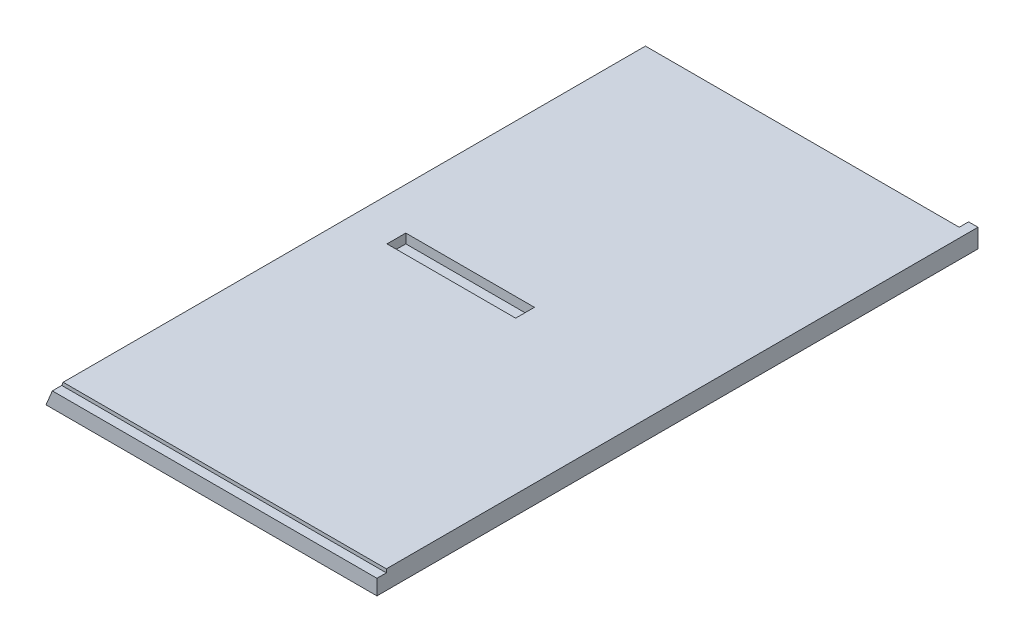
ISO-10303-21;
HEADER;
FILE_DESCRIPTION(('STEP AP214'),'2;1');
FILE_NAME('part.step','',(''),(''),'','','');
FILE_SCHEMA(('AUTOMOTIVE_DESIGN { 1 0 10303 214 1 1 1 1 }'));
ENDSEC;
DATA;
#1=APPLICATION_CONTEXT('core data for automotive mechanical design processes');
#2=APPLICATION_PROTOCOL_DEFINITION('international standard','automotive_design',2000,#1);
#3=PRODUCT_CONTEXT('',#1,'mechanical');
#4=PRODUCT('Part','Part','',(#3));
#5=PRODUCT_RELATED_PRODUCT_CATEGORY('part','',(#4));
#6=PRODUCT_DEFINITION_FORMATION('','',#4);
#7=PRODUCT_DEFINITION_CONTEXT('part definition',#1,'design');
#8=PRODUCT_DEFINITION('design','',#6,#7);
#9=PRODUCT_DEFINITION_SHAPE('','',#8);
#10=(LENGTH_UNIT() NAMED_UNIT(*) SI_UNIT(.MILLI.,.METRE.));
#11=(NAMED_UNIT(*) PLANE_ANGLE_UNIT() SI_UNIT($,.RADIAN.));
#12=(NAMED_UNIT(*) SI_UNIT($,.STERADIAN.) SOLID_ANGLE_UNIT());
#13=UNCERTAINTY_MEASURE_WITH_UNIT(LENGTH_MEASURE(1.E-05),#10,'distance_accuracy_value','');
#14=(GEOMETRIC_REPRESENTATION_CONTEXT(3) GLOBAL_UNCERTAINTY_ASSIGNED_CONTEXT((#13)) GLOBAL_UNIT_ASSIGNED_CONTEXT((#10,
#11,#12)) REPRESENTATION_CONTEXT('',''));
#15=CARTESIAN_POINT('',(0.,0.,0.));
#16=DIRECTION('',(0.,0.,1.));
#17=DIRECTION('',(1.,0.,0.));
#18=AXIS2_PLACEMENT_3D('',#15,#16,#17);
#19=CARTESIAN_POINT('',(5.26051224213836,12.7,406.4));
#20=DIRECTION('',(0.,-1.,0.));
#21=DIRECTION('',(1.,0.,0.));
#22=AXIS2_PLACEMENT_3D('',#19,#20,#21);
#23=PLANE('',#22);
#24=DIRECTION('',(0.,0.,-1.));
#25=VECTOR('',#24,1.);
#26=CARTESIAN_POINT('',(120.698548215533,12.7,209.55));
#27=LINE('',#26,#25);
#28=CARTESIAN_POINT('',(120.698548215533,12.7,209.55));
#29=VERTEX_POINT('',#28);
#30=CARTESIAN_POINT('',(120.698548215533,12.7,196.85));
#31=VERTEX_POINT('',#30);
#32=EDGE_CURVE('E48',#29,#31,#27,.T.);
#33=ORIENTED_EDGE('',*,*,#32,.F.);
#34=DIRECTION('',(-1.,0.,0.));
#35=VECTOR('',#34,1.);
#36=CARTESIAN_POINT('',(5.26051224213836,12.7,209.55));
#37=LINE('',#36,#35);
#38=CARTESIAN_POINT('',(33.7223472653998,12.6999999999999,209.55));
#39=VERTEX_POINT('',#38);
#40=EDGE_CURVE('E148',#29,#39,#37,.T.);
#41=ORIENTED_EDGE('',*,*,#40,.T.);
#42=DIRECTION('',(0.,0.,-1.));
#43=VECTOR('',#42,1.);
#44=CARTESIAN_POINT('',(33.7223472653998,12.6999999999999,209.55));
#45=LINE('',#44,#43);
#46=CARTESIAN_POINT('',(33.7223472653998,12.6999999999999,196.85));
#47=VERTEX_POINT('',#46);
#48=EDGE_CURVE('E131',#39,#47,#45,.T.);
#49=ORIENTED_EDGE('',*,*,#48,.T.);
#50=DIRECTION('',(-1.,0.,0.));
#51=VECTOR('',#50,1.);
#52=CARTESIAN_POINT('',(5.26051224213836,12.7,196.85));
#53=LINE('',#52,#51);
#54=EDGE_CURVE('E141',#31,#47,#53,.T.);
#55=ORIENTED_EDGE('',*,*,#54,.F.);
#56=EDGE_LOOP('',(#33,#41,#49,#55));
#57=FACE_BOUND('',#56,.T.);
#58=DIRECTION('',(-1.,0.,0.));
#59=VECTOR('',#58,1.);
#60=CARTESIAN_POINT('',(217.424,12.7,6.35));
#61=LINE('',#60,#59);
#62=CARTESIAN_POINT('',(217.424,12.7,6.35));
#63=VERTEX_POINT('',#62);
#64=CARTESIAN_POINT('',(5.26051224213836,12.7,6.34999999999997));
#65=VERTEX_POINT('',#64);
#66=EDGE_CURVE('E176',#63,#65,#61,.T.);
#67=ORIENTED_EDGE('',*,*,#66,.T.);
#68=DIRECTION('',(0.,0.,-1.));
#69=VECTOR('',#68,1.);
#70=CARTESIAN_POINT('',(5.26051224213836,12.7,406.4));
#71=LINE('',#70,#69);
#72=CARTESIAN_POINT('',(5.26051224213836,12.7,400.05));
#73=VERTEX_POINT('',#72);
#74=EDGE_CURVE('E213',#73,#65,#71,.T.);
#75=ORIENTED_EDGE('',*,*,#74,.F.);
#76=DIRECTION('',(1.,0.,0.));
#77=VECTOR('',#76,1.);
#78=CARTESIAN_POINT('',(0.,12.7,400.05));
#79=LINE('',#78,#77);
#80=CARTESIAN_POINT('',(223.774,12.7,400.05));
#81=VERTEX_POINT('',#80);
#82=EDGE_CURVE('E153',#73,#81,#79,.T.);
#83=ORIENTED_EDGE('',*,*,#82,.T.);
#84=DIRECTION('',(0.,0.,-1.));
#85=VECTOR('',#84,1.);
#86=CARTESIAN_POINT('',(223.774,12.7,406.4));
#87=LINE('',#86,#85);
#88=CARTESIAN_POINT('',(223.774,12.7,0.));
#89=VERTEX_POINT('',#88);
#90=EDGE_CURVE('E215',#81,#89,#87,.T.);
#91=ORIENTED_EDGE('',*,*,#90,.T.);
#92=DIRECTION('',(-1.,0.,0.));
#93=VECTOR('',#92,1.);
#94=CARTESIAN_POINT('',(5.26051224213836,12.7,0.));
#95=LINE('',#94,#93);
#96=CARTESIAN_POINT('',(217.424,12.7,0.));
#97=VERTEX_POINT('',#96);
#98=EDGE_CURVE('E207',#89,#97,#95,.T.);
#99=ORIENTED_EDGE('',*,*,#98,.T.);
#100=DIRECTION('',(0.,0.,1.));
#101=VECTOR('',#100,1.);
#102=CARTESIAN_POINT('',(217.424,12.7,6.35));
#103=LINE('',#102,#101);
#104=EDGE_CURVE('E171',#97,#63,#103,.T.);
#105=ORIENTED_EDGE('',*,*,#104,.T.);
#106=EDGE_LOOP('',(#67,#75,#83,#91,#99,#105));
#107=FACE_BOUND('',#106,.T.);
#108=ADVANCED_FACE('F33',(#57,#107),#23,.F.);
#109=CARTESIAN_POINT('',(0.,0.,406.4));
#110=DIRECTION('',(0.923879532511285,-0.382683432365094,0.));
#111=DIRECTION('',(0.382683432365094,0.923879532511285,0.));
#112=AXIS2_PLACEMENT_3D('',#109,#110,#111);
#113=PLANE('',#112);
#114=DIRECTION('',(-0.382683432365094,-0.923879532511285,0.));
#115=VECTOR('',#114,1.);
#116=CARTESIAN_POINT('',(0.,0.,400.05));
#117=LINE('',#116,#115);
#118=CARTESIAN_POINT('',(4.28205696510062,10.3378,400.05));
#119=VERTEX_POINT('',#118);
#120=EDGE_CURVE('E169',#73,#119,#117,.T.);
#121=ORIENTED_EDGE('',*,*,#120,.F.);
#122=ORIENTED_EDGE('',*,*,#74,.T.);
#123=DIRECTION('',(0.382683432365094,0.923879532511285,0.));
#124=VECTOR('',#123,1.);
#125=CARTESIAN_POINT('',(0.,0.,6.35000000000002));
#126=LINE('',#125,#124);
#127=CARTESIAN_POINT('',(2.63025612106918,6.34999999999997,6.34999999999997));
#128=VERTEX_POINT('',#127);
#129=EDGE_CURVE('E11',#128,#65,#126,.T.);
#130=ORIENTED_EDGE('',*,*,#129,.F.);
#131=DIRECTION('',(0.,0.,1.));
#132=VECTOR('',#131,1.);
#133=CARTESIAN_POINT('',(2.63025612106917,6.34999999999997,406.4));
#134=LINE('',#133,#132);
#135=CARTESIAN_POINT('',(2.63025612106918,6.34999999999997,0.));
#136=VERTEX_POINT('',#135);
#137=EDGE_CURVE('E189',#136,#128,#134,.T.);
#138=ORIENTED_EDGE('',*,*,#137,.F.);
#139=DIRECTION('',(-0.382683432365094,-0.923879532511285,0.));
#140=VECTOR('',#139,1.);
#141=CARTESIAN_POINT('',(0.,0.,0.));
#142=LINE('',#141,#140);
#143=CARTESIAN_POINT('',(0.,0.,0.));
#144=VERTEX_POINT('',#143);
#145=EDGE_CURVE('E196',#136,#144,#142,.T.);
#146=ORIENTED_EDGE('',*,*,#145,.T.);
#147=DIRECTION('',(0.,0.,-1.));
#148=VECTOR('',#147,1.);
#149=CARTESIAN_POINT('',(0.,0.,406.4));
#150=LINE('',#149,#148);
#151=CARTESIAN_POINT('',(0.,0.,406.4));
#152=VERTEX_POINT('',#151);
#153=EDGE_CURVE('E201',#152,#144,#150,.T.);
#154=ORIENTED_EDGE('',*,*,#153,.F.);
#155=DIRECTION('',(-0.382683432365094,-0.923879532511285,0.));
#156=VECTOR('',#155,1.);
#157=CARTESIAN_POINT('',(0.,0.,406.4));
#158=LINE('',#157,#156);
#159=CARTESIAN_POINT('',(4.28205696510062,10.3378,406.4));
#160=VERTEX_POINT('',#159);
#161=EDGE_CURVE('E199',#160,#152,#158,.T.);
#162=ORIENTED_EDGE('',*,*,#161,.F.);
#163=DIRECTION('',(0.,0.,-1.));
#164=VECTOR('',#163,1.);
#165=CARTESIAN_POINT('',(4.28205696510062,10.3378,406.4));
#166=LINE('',#165,#164);
#167=EDGE_CURVE('E56',#160,#119,#166,.T.);
#168=ORIENTED_EDGE('',*,*,#167,.T.);
#169=EDGE_LOOP('',(#121,#122,#130,#138,#146,#154,#162,#168));
#170=FACE_BOUND('',#169,.T.);
#171=ADVANCED_FACE('F229',(#170),#113,.F.);
#172=CARTESIAN_POINT('',(223.774,12.7,406.4));
#173=DIRECTION('',(-1.,0.,0.));
#174=DIRECTION('',(0.,0.,1.));
#175=AXIS2_PLACEMENT_3D('',#172,#173,#174);
#176=PLANE('',#175);
#177=DIRECTION('',(0.,1.,0.));
#178=VECTOR('',#177,1.);
#179=CARTESIAN_POINT('',(223.774,10.3378,400.05));
#180=LINE('',#179,#178);
#181=CARTESIAN_POINT('',(223.774,10.3378,400.05));
#182=VERTEX_POINT('',#181);
#183=EDGE_CURVE('E165',#182,#81,#180,.T.);
#184=ORIENTED_EDGE('',*,*,#183,.F.);
#185=DIRECTION('',(0.,0.,1.));
#186=VECTOR('',#185,1.);
#187=CARTESIAN_POINT('',(223.774,10.3378,406.4));
#188=LINE('',#187,#186);
#189=CARTESIAN_POINT('',(223.774,10.3378,406.4));
#190=VERTEX_POINT('',#189);
#191=EDGE_CURVE('E161',#182,#190,#188,.T.);
#192=ORIENTED_EDGE('',*,*,#191,.T.);
#193=DIRECTION('',(0.,1.,0.));
#194=VECTOR('',#193,1.);
#195=CARTESIAN_POINT('',(223.774,12.7,406.4));
#196=LINE('',#195,#194);
#197=CARTESIAN_POINT('',(223.774,0.,406.4));
#198=VERTEX_POINT('',#197);
#199=EDGE_CURVE('E195',#198,#190,#196,.T.);
#200=ORIENTED_EDGE('',*,*,#199,.F.);
#201=DIRECTION('',(0.,0.,-1.));
#202=VECTOR('',#201,1.);
#203=CARTESIAN_POINT('',(223.774,0.,406.4));
#204=LINE('',#203,#202);
#205=CARTESIAN_POINT('',(223.774,0.,0.));
#206=VERTEX_POINT('',#205);
#207=EDGE_CURVE('E217',#198,#206,#204,.T.);
#208=ORIENTED_EDGE('',*,*,#207,.T.);
#209=DIRECTION('',(0.,1.,0.));
#210=VECTOR('',#209,1.);
#211=CARTESIAN_POINT('',(223.774,12.7,0.));
#212=LINE('',#211,#210);
#213=EDGE_CURVE('E204',#206,#89,#212,.T.);
#214=ORIENTED_EDGE('',*,*,#213,.T.);
#215=ORIENTED_EDGE('',*,*,#90,.F.);
#216=EDGE_LOOP('',(#184,#192,#200,#208,#214,#215));
#217=FACE_BOUND('',#216,.T.);
#218=ADVANCED_FACE('F244',(#217),#176,.F.);
#219=CARTESIAN_POINT('',(0.,0.,0.));
#220=DIRECTION('',(0.,0.,1.));
#221=DIRECTION('',(1.,0.,0.));
#222=AXIS2_PLACEMENT_3D('',#219,#220,#221);
#223=PLANE('',#222);
#224=DIRECTION('',(0.,1.,0.));
#225=VECTOR('',#224,1.);
#226=CARTESIAN_POINT('',(217.424,6.34999999999999,0.));
#227=LINE('',#226,#225);
#228=CARTESIAN_POINT('',(217.424,6.34999999999999,0.));
#229=VERTEX_POINT('',#228);
#230=EDGE_CURVE('E179',#229,#97,#227,.T.);
#231=ORIENTED_EDGE('',*,*,#230,.T.);
#232=ORIENTED_EDGE('',*,*,#98,.F.);
#233=ORIENTED_EDGE('',*,*,#213,.F.);
#234=DIRECTION('',(1.,0.,0.));
#235=VECTOR('',#234,1.);
#236=CARTESIAN_POINT('',(223.774,0.,0.));
#237=LINE('',#236,#235);
#238=EDGE_CURVE('E191',#144,#206,#237,.T.);
#239=ORIENTED_EDGE('',*,*,#238,.F.);
#240=ORIENTED_EDGE('',*,*,#145,.F.);
#241=DIRECTION('',(-1.,0.,0.));
#242=VECTOR('',#241,1.);
#243=CARTESIAN_POINT('',(0.,6.34999999999997,0.));
#244=LINE('',#243,#242);
#245=EDGE_CURVE('E41',#229,#136,#244,.T.);
#246=ORIENTED_EDGE('',*,*,#245,.F.);
#247=EDGE_LOOP('',(#231,#232,#233,#239,#240,#246));
#248=FACE_BOUND('',#247,.T.);
#249=ADVANCED_FACE('F232',(#248),#223,.F.);
#250=CARTESIAN_POINT('',(223.774,0.,406.4));
#251=DIRECTION('',(0.,1.,0.));
#252=DIRECTION('',(-1.,0.,0.));
#253=AXIS2_PLACEMENT_3D('',#250,#251,#252);
#254=PLANE('',#253);
#255=ORIENTED_EDGE('',*,*,#238,.T.);
#256=ORIENTED_EDGE('',*,*,#207,.F.);
#257=DIRECTION('',(1.,0.,0.));
#258=VECTOR('',#257,1.);
#259=CARTESIAN_POINT('',(223.774,0.,406.4));
#260=LINE('',#259,#258);
#261=EDGE_CURVE('E192',#152,#198,#260,.T.);
#262=ORIENTED_EDGE('',*,*,#261,.F.);
#263=ORIENTED_EDGE('',*,*,#153,.T.);
#264=EDGE_LOOP('',(#255,#256,#262,#263));
#265=FACE_BOUND('',#264,.T.);
#266=ADVANCED_FACE('F35',(#265),#254,.F.);
#267=CARTESIAN_POINT('',(0.,0.,406.4));
#268=DIRECTION('',(0.,0.,1.));
#269=DIRECTION('',(1.,0.,0.));
#270=AXIS2_PLACEMENT_3D('',#267,#268,#269);
#271=PLANE('',#270);
#272=DIRECTION('',(-1.,0.,0.));
#273=VECTOR('',#272,1.);
#274=CARTESIAN_POINT('',(0.,10.3378,406.4));
#275=LINE('',#274,#273);
#276=EDGE_CURVE('E164',#190,#160,#275,.T.);
#277=ORIENTED_EDGE('',*,*,#276,.T.);
#278=ORIENTED_EDGE('',*,*,#161,.T.);
#279=ORIENTED_EDGE('',*,*,#261,.T.);
#280=ORIENTED_EDGE('',*,*,#199,.T.);
#281=EDGE_LOOP('',(#277,#278,#279,#280));
#282=FACE_BOUND('',#281,.T.);
#283=ADVANCED_FACE('F239',(#282),#271,.T.);
#284=CARTESIAN_POINT('',(217.424,6.34999999999999,6.35));
#285=DIRECTION('',(0.,0.,-1.));
#286=DIRECTION('',(-1.,0.,0.));
#287=AXIS2_PLACEMENT_3D('',#284,#285,#286);
#288=PLANE('',#287);
#289=ORIENTED_EDGE('',*,*,#129,.T.);
#290=ORIENTED_EDGE('',*,*,#66,.F.);
#291=DIRECTION('',(0.,1.,0.));
#292=VECTOR('',#291,1.);
#293=CARTESIAN_POINT('',(217.424,6.34999999999999,6.35));
#294=LINE('',#293,#292);
#295=CARTESIAN_POINT('',(217.424,6.34999999999999,6.35));
#296=VERTEX_POINT('',#295);
#297=EDGE_CURVE('E186',#296,#63,#294,.T.);
#298=ORIENTED_EDGE('',*,*,#297,.F.);
#299=DIRECTION('',(-1.,0.,0.));
#300=VECTOR('',#299,1.);
#301=CARTESIAN_POINT('',(217.424,6.34999999999999,6.35));
#302=LINE('',#301,#300);
#303=EDGE_CURVE('E175',#296,#128,#302,.T.);
#304=ORIENTED_EDGE('',*,*,#303,.T.);
#305=EDGE_LOOP('',(#289,#290,#298,#304));
#306=FACE_BOUND('',#305,.T.);
#307=ADVANCED_FACE('F250',(#306),#288,.T.);
#308=CARTESIAN_POINT('',(0.,6.34999999999997,0.));
#309=DIRECTION('',(0.,1.,0.));
#310=DIRECTION('',(-1.,0.,0.));
#311=AXIS2_PLACEMENT_3D('',#308,#309,#310);
#312=PLANE('',#311);
#313=ORIENTED_EDGE('',*,*,#137,.T.);
#314=ORIENTED_EDGE('',*,*,#303,.F.);
#315=DIRECTION('',(0.,0.,1.));
#316=VECTOR('',#315,1.);
#317=CARTESIAN_POINT('',(217.424,6.34999999999999,6.35));
#318=LINE('',#317,#316);
#319=EDGE_CURVE('E172',#229,#296,#318,.T.);
#320=ORIENTED_EDGE('',*,*,#319,.F.);
#321=ORIENTED_EDGE('',*,*,#245,.T.);
#322=EDGE_LOOP('',(#313,#314,#320,#321));
#323=FACE_BOUND('',#322,.T.);
#324=ADVANCED_FACE('F222',(#323),#312,.T.);
#325=CARTESIAN_POINT('',(217.424,6.34999999999999,6.35));
#326=DIRECTION('',(-1.,0.,0.));
#327=DIRECTION('',(0.,-1.,0.));
#328=AXIS2_PLACEMENT_3D('',#325,#326,#327);
#329=PLANE('',#328);
#330=ORIENTED_EDGE('',*,*,#104,.F.);
#331=ORIENTED_EDGE('',*,*,#230,.F.);
#332=ORIENTED_EDGE('',*,*,#319,.T.);
#333=ORIENTED_EDGE('',*,*,#297,.T.);
#334=EDGE_LOOP('',(#330,#331,#332,#333));
#335=FACE_BOUND('',#334,.T.);
#336=ADVANCED_FACE('F253',(#335),#329,.T.);
#337=CARTESIAN_POINT('',(0.,10.3378,400.05));
#338=DIRECTION('',(0.,0.,1.));
#339=DIRECTION('',(1.,0.,0.));
#340=AXIS2_PLACEMENT_3D('',#337,#338,#339);
#341=PLANE('',#340);
#342=ORIENTED_EDGE('',*,*,#120,.T.);
#343=DIRECTION('',(1.,0.,0.));
#344=VECTOR('',#343,1.);
#345=CARTESIAN_POINT('',(0.,10.3378,400.05));
#346=LINE('',#345,#344);
#347=EDGE_CURVE('E156',#119,#182,#346,.T.);
#348=ORIENTED_EDGE('',*,*,#347,.T.);
#349=ORIENTED_EDGE('',*,*,#183,.T.);
#350=ORIENTED_EDGE('',*,*,#82,.F.);
#351=EDGE_LOOP('',(#342,#348,#349,#350));
#352=FACE_BOUND('',#351,.T.);
#353=ADVANCED_FACE('F247',(#352),#341,.T.);
#354=CARTESIAN_POINT('',(0.,10.3378,0.));
#355=DIRECTION('',(0.,-1.,0.));
#356=DIRECTION('',(1.,0.,0.));
#357=AXIS2_PLACEMENT_3D('',#354,#355,#356);
#358=PLANE('',#357);
#359=ORIENTED_EDGE('',*,*,#276,.F.);
#360=ORIENTED_EDGE('',*,*,#191,.F.);
#361=ORIENTED_EDGE('',*,*,#347,.F.);
#362=ORIENTED_EDGE('',*,*,#167,.F.);
#363=EDGE_LOOP('',(#359,#360,#361,#362));
#364=FACE_BOUND('',#363,.T.);
#365=ADVANCED_FACE('F241',(#364),#358,.F.);
#366=CARTESIAN_POINT('',(-886.993305173515,767.615446324431,209.55));
#367=DIRECTION('',(0.,0.,1.));
#368=DIRECTION('',(0.,-1.,0.));
#369=AXIS2_PLACEMENT_3D('',#366,#367,#368);
#370=PLANE('',#369);
#371=DIRECTION('',(0.,1.,0.));
#372=VECTOR('',#371,1.);
#373=CARTESIAN_POINT('',(120.698548215533,12.7,209.55));
#374=LINE('',#373,#372);
#375=CARTESIAN_POINT('',(120.698548215533,6.35000000000008,209.55));
#376=VERTEX_POINT('',#375);
#377=EDGE_CURVE('E395',#376,#29,#374,.T.);
#378=ORIENTED_EDGE('',*,*,#377,.F.);
#379=DIRECTION('',(1.,0.,0.));
#380=VECTOR('',#379,1.);
#381=CARTESIAN_POINT('',(120.698548215533,6.35000000000008,209.55));
#382=LINE('',#381,#380);
#383=CARTESIAN_POINT('',(33.7223472653998,6.34999999999997,209.55));
#384=VERTEX_POINT('',#383);
#385=EDGE_CURVE('E149',#384,#376,#382,.T.);
#386=ORIENTED_EDGE('',*,*,#385,.F.);
#387=DIRECTION('',(0.,-1.,0.));
#388=VECTOR('',#387,1.);
#389=CARTESIAN_POINT('',(33.7223472653998,6.34999999999997,209.55));
#390=LINE('',#389,#388);
#391=EDGE_CURVE('E135',#39,#384,#390,.T.);
#392=ORIENTED_EDGE('',*,*,#391,.F.);
#393=ORIENTED_EDGE('',*,*,#40,.F.);
#394=EDGE_LOOP('',(#378,#386,#392,#393));
#395=FACE_BOUND('',#394,.T.);
#396=ADVANCED_FACE('F147',(#395),#370,.F.);
#397=CARTESIAN_POINT('',(-886.993305173515,767.615446324431,196.85));
#398=DIRECTION('',(0.,0.,1.));
#399=DIRECTION('',(0.,-1.,0.));
#400=AXIS2_PLACEMENT_3D('',#397,#398,#399);
#401=PLANE('',#400);
#402=ORIENTED_EDGE('',*,*,#54,.T.);
#403=DIRECTION('',(0.,-1.,0.));
#404=VECTOR('',#403,1.);
#405=CARTESIAN_POINT('',(33.7223472653998,6.34999999999997,196.85));
#406=LINE('',#405,#404);
#407=CARTESIAN_POINT('',(33.7223472653998,6.34999999999997,196.85));
#408=VERTEX_POINT('',#407);
#409=EDGE_CURVE('E137',#47,#408,#406,.T.);
#410=ORIENTED_EDGE('',*,*,#409,.T.);
#411=DIRECTION('',(1.,0.,0.));
#412=VECTOR('',#411,1.);
#413=CARTESIAN_POINT('',(120.698548215533,6.35000000000008,196.85));
#414=LINE('',#413,#412);
#415=CARTESIAN_POINT('',(120.698548215533,6.35000000000008,196.85));
#416=VERTEX_POINT('',#415);
#417=EDGE_CURVE('E386',#408,#416,#414,.T.);
#418=ORIENTED_EDGE('',*,*,#417,.T.);
#419=DIRECTION('',(0.,1.,0.));
#420=VECTOR('',#419,1.);
#421=CARTESIAN_POINT('',(120.698548215533,12.7,196.85));
#422=LINE('',#421,#420);
#423=EDGE_CURVE('E150',#416,#31,#422,.T.);
#424=ORIENTED_EDGE('',*,*,#423,.T.);
#425=EDGE_LOOP('',(#402,#410,#418,#424));
#426=FACE_BOUND('',#425,.T.);
#427=ADVANCED_FACE('F290',(#426),#401,.T.);
#428=CARTESIAN_POINT('',(33.7223472653998,6.34999999999997,209.55));
#429=DIRECTION('',(1.,0.,0.));
#430=DIRECTION('',(0.,0.,1.));
#431=AXIS2_PLACEMENT_3D('',#428,#429,#430);
#432=PLANE('',#431);
#433=ORIENTED_EDGE('',*,*,#409,.F.);
#434=ORIENTED_EDGE('',*,*,#48,.F.);
#435=ORIENTED_EDGE('',*,*,#391,.T.);
#436=DIRECTION('',(0.,0.,-1.));
#437=VECTOR('',#436,1.);
#438=CARTESIAN_POINT('',(33.7223472653998,6.34999999999997,209.55));
#439=LINE('',#438,#437);
#440=EDGE_CURVE('E142',#384,#408,#439,.T.);
#441=ORIENTED_EDGE('',*,*,#440,.T.);
#442=EDGE_LOOP('',(#433,#434,#435,#441));
#443=FACE_BOUND('',#442,.T.);
#444=ADVANCED_FACE('F133',(#443),#432,.T.);
#445=CARTESIAN_POINT('',(120.698548215533,6.35000000000008,209.55));
#446=DIRECTION('',(0.,1.,0.));
#447=DIRECTION('',(0.,0.,1.));
#448=AXIS2_PLACEMENT_3D('',#445,#446,#447);
#449=PLANE('',#448);
#450=ORIENTED_EDGE('',*,*,#417,.F.);
#451=ORIENTED_EDGE('',*,*,#440,.F.);
#452=ORIENTED_EDGE('',*,*,#385,.T.);
#453=DIRECTION('',(0.,0.,-1.));
#454=VECTOR('',#453,1.);
#455=CARTESIAN_POINT('',(120.698548215533,6.35000000000008,209.55));
#456=LINE('',#455,#454);
#457=EDGE_CURVE('E394',#376,#416,#456,.T.);
#458=ORIENTED_EDGE('',*,*,#457,.T.);
#459=EDGE_LOOP('',(#450,#451,#452,#458));
#460=FACE_BOUND('',#459,.T.);
#461=ADVANCED_FACE('F289',(#460),#449,.T.);
#462=CARTESIAN_POINT('',(120.698548215533,12.7,209.55));
#463=DIRECTION('',(-1.,0.,0.));
#464=DIRECTION('',(0.,0.,-1.));
#465=AXIS2_PLACEMENT_3D('',#462,#463,#464);
#466=PLANE('',#465);
#467=ORIENTED_EDGE('',*,*,#423,.F.);
#468=ORIENTED_EDGE('',*,*,#457,.F.);
#469=ORIENTED_EDGE('',*,*,#377,.T.);
#470=ORIENTED_EDGE('',*,*,#32,.T.);
#471=EDGE_LOOP('',(#467,#468,#469,#470));
#472=FACE_BOUND('',#471,.T.);
#473=ADVANCED_FACE('F293',(#472),#466,.T.);
#474=CLOSED_SHELL('',(#108,#171,#218,#249,#266,#283,#307,#324,#336,#353,#365,#396,#427,#444,
#461,#473));
#475=MANIFOLD_SOLID_BREP('B2',#474);
#476=ADVANCED_BREP_SHAPE_REPRESENTATION('',(#18,#475),#14);
#477=SHAPE_DEFINITION_REPRESENTATION(#9,#476);
ENDSEC;
END-ISO-10303-21;
